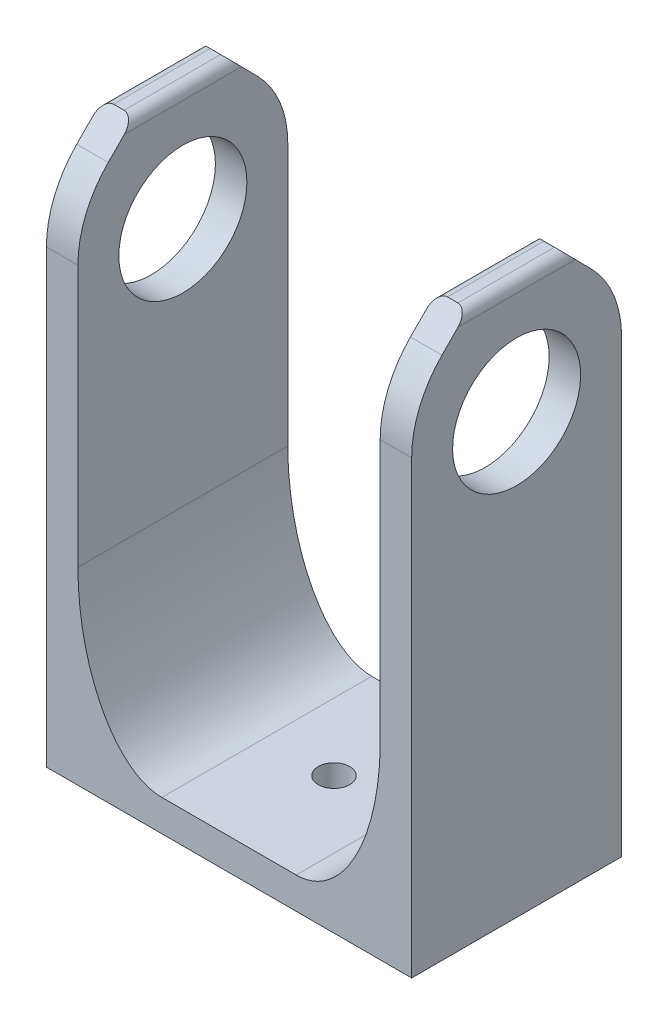
ISO-10303-21;
HEADER;
FILE_DESCRIPTION(('STEP AP214'),'2;1');
FILE_NAME('part.step','',(''),(''),'','','');
FILE_SCHEMA(('AUTOMOTIVE_DESIGN { 1 0 10303 214 1 1 1 1 }'));
ENDSEC;
DATA;
#1=APPLICATION_CONTEXT('core data for automotive mechanical design processes');
#2=APPLICATION_PROTOCOL_DEFINITION('international standard','automotive_design',2000,#1);
#3=PRODUCT_CONTEXT('',#1,'mechanical');
#4=PRODUCT('Part','Part','',(#3));
#5=PRODUCT_RELATED_PRODUCT_CATEGORY('part','',(#4));
#6=PRODUCT_DEFINITION_FORMATION('','',#4);
#7=PRODUCT_DEFINITION_CONTEXT('part definition',#1,'design');
#8=PRODUCT_DEFINITION('design','',#6,#7);
#9=PRODUCT_DEFINITION_SHAPE('','',#8);
#10=(LENGTH_UNIT() NAMED_UNIT(*) SI_UNIT(.MILLI.,.METRE.));
#11=(NAMED_UNIT(*) PLANE_ANGLE_UNIT() SI_UNIT($,.RADIAN.));
#12=(NAMED_UNIT(*) SI_UNIT($,.STERADIAN.) SOLID_ANGLE_UNIT());
#13=UNCERTAINTY_MEASURE_WITH_UNIT(LENGTH_MEASURE(1.E-05),#10,'distance_accuracy_value','');
#14=(GEOMETRIC_REPRESENTATION_CONTEXT(3) GLOBAL_UNCERTAINTY_ASSIGNED_CONTEXT((#13)) GLOBAL_UNIT_ASSIGNED_CONTEXT((#10,
#11,#12)) REPRESENTATION_CONTEXT('',''));
#15=CARTESIAN_POINT('',(0.,0.,0.));
#16=DIRECTION('',(0.,0.,1.));
#17=DIRECTION('',(1.,0.,0.));
#18=AXIS2_PLACEMENT_3D('',#15,#16,#17);
#19=CARTESIAN_POINT('',(-18.0339316449471,1.33142857142857,20.));
#20=DIRECTION('',(1.,0.,0.));
#21=DIRECTION('',(0.,0.,-1.));
#22=AXIS2_PLACEMENT_3D('',#19,#20,#21);
#23=PLANE('',#22);
#24=CARTESIAN_POINT('',(-18.0339316449471,10.5436734693878,10.));
#25=DIRECTION('',(1.,0.,0.));
#26=DIRECTION('',(0.,0.,-1.));
#27=AXIS2_PLACEMENT_3D('',#24,#25,#26);
#28=CIRCLE('',#27,6.1);
#29=CARTESIAN_POINT('',(-18.0339316449471,10.5436734693878,3.9));
#30=VERTEX_POINT('',#29);
#31=EDGE_CURVE('E650',#30,#30,#28,.F.);
#32=ORIENTED_EDGE('',*,*,#31,.F.);
#33=EDGE_LOOP('',(#32));
#34=FACE_BOUND('',#33,.T.);
#35=DIRECTION('',(0.,-1.,0.));
#36=VECTOR('',#35,1.);
#37=CARTESIAN_POINT('',(-18.0339316449471,20.3165435613168,20.));
#38=LINE('',#37,#36);
#39=CARTESIAN_POINT('',(-18.0339316449471,11.7410548552474,20.));
#40=VERTEX_POINT('',#39);
#41=CARTESIAN_POINT('',(-18.0339316449471,-31.1834564386832,20.));
#42=VERTEX_POINT('',#41);
#43=EDGE_CURVE('E639',#40,#42,#38,.T.);
#44=ORIENTED_EDGE('',*,*,#43,.F.);
#45=CARTESIAN_POINT('',(-18.0339316449471,11.7410548552474,10.));
#46=DIRECTION('',(1.,0.,0.));
#47=DIRECTION('',(0.,0.,-1.));
#48=AXIS2_PLACEMENT_3D('',#45,#46,#47);
#49=CIRCLE('',#48,10.);
#50=CARTESIAN_POINT('',(-18.0339316449471,18.7687746927255,17.1141516631231));
#51=VERTEX_POINT('',#50);
#52=EDGE_CURVE('E308',#40,#51,#49,.F.);
#53=ORIENTED_EDGE('',*,*,#52,.T.);
#54=DIRECTION('',(0.,-0.711415166312307,0.702771983747811));
#55=VECTOR('',#54,1.);
#56=CARTESIAN_POINT('',(-18.0339316449471,15.8474341697542,20.));
#57=LINE('',#56,#55);
#58=CARTESIAN_POINT('',(-18.0339316449471,20.3165435613168,15.585187073007));
#59=VERTEX_POINT('',#58);
#60=EDGE_CURVE('E231',#59,#51,#57,.T.);
#61=ORIENTED_EDGE('',*,*,#60,.F.);
#62=DIRECTION('',(0.,0.,-1.));
#63=VECTOR('',#62,1.);
#64=CARTESIAN_POINT('',(-18.0339316449471,20.3165435613168,20.));
#65=LINE('',#64,#63);
#66=CARTESIAN_POINT('',(-18.0339316449471,20.3165435613168,4.41481292699299));
#67=VERTEX_POINT('',#66);
#68=EDGE_CURVE('E222',#59,#67,#65,.T.);
#69=ORIENTED_EDGE('',*,*,#68,.T.);
#70=DIRECTION('',(0.,0.711415166312306,0.702771983747812));
#71=VECTOR('',#70,1.);
#72=CARTESIAN_POINT('',(-18.0339316449471,15.8474341697542,0.));
#73=LINE('',#72,#71);
#74=CARTESIAN_POINT('',(-18.0339316449471,18.7687746927255,2.88584833687694));
#75=VERTEX_POINT('',#74);
#76=EDGE_CURVE('E203',#75,#67,#73,.T.);
#77=ORIENTED_EDGE('',*,*,#76,.F.);
#78=CARTESIAN_POINT('',(-18.0339316449471,11.7410548552474,10.));
#79=DIRECTION('',(1.,0.,0.));
#80=DIRECTION('',(0.,0.,-1.));
#81=AXIS2_PLACEMENT_3D('',#78,#79,#80);
#82=CIRCLE('',#81,10.);
#83=CARTESIAN_POINT('',(-18.0339316449471,11.7410548552474,0.));
#84=VERTEX_POINT('',#83);
#85=EDGE_CURVE('E305',#75,#84,#82,.F.);
#86=ORIENTED_EDGE('',*,*,#85,.T.);
#87=DIRECTION('',(0.,-1.,0.));
#88=VECTOR('',#87,1.);
#89=CARTESIAN_POINT('',(-18.0339316449471,1.33142857142857,0.));
#90=LINE('',#89,#88);
#91=CARTESIAN_POINT('',(-18.0339316449471,-31.1834564386832,0.));
#92=VERTEX_POINT('',#91);
#93=EDGE_CURVE('E349',#84,#92,#90,.T.);
#94=ORIENTED_EDGE('',*,*,#93,.T.);
#95=DIRECTION('',(0.,0.,-1.));
#96=VECTOR('',#95,1.);
#97=CARTESIAN_POINT('',(-18.0339316449471,-31.1834564386832,20.));
#98=LINE('',#97,#96);
#99=EDGE_CURVE('E272',#42,#92,#98,.T.);
#100=ORIENTED_EDGE('',*,*,#99,.F.);
#101=EDGE_LOOP('',(#44,#53,#61,#69,#77,#86,#94,#100));
#102=FACE_BOUND('',#101,.T.);
#103=ADVANCED_FACE('F46',(#34,#102),#23,.F.);
#104=CARTESIAN_POINT('',(-18.0339316449471,-31.1834564386832,20.));
#105=DIRECTION('',(0.,1.,0.));
#106=DIRECTION('',(0.,0.,1.));
#107=AXIS2_PLACEMENT_3D('',#104,#105,#106);
#108=PLANE('',#107);
#109=CARTESIAN_POINT('',(-0.633931644947133,-31.1834564386832,10.));
#110=DIRECTION('',(0.,-1.,0.));
#111=DIRECTION('',(1.,0.,0.));
#112=AXIS2_PLACEMENT_3D('',#109,#110,#111);
#113=CIRCLE('',#112,1.5);
#114=CARTESIAN_POINT('',(0.866068355052867,-31.1834564386832,10.));
#115=VERTEX_POINT('',#114);
#116=EDGE_CURVE('E288',#115,#115,#113,.T.);
#117=ORIENTED_EDGE('',*,*,#116,.F.);
#118=EDGE_LOOP('',(#117));
#119=FACE_BOUND('',#118,.T.);
#120=DIRECTION('',(1.,0.,0.));
#121=VECTOR('',#120,1.);
#122=CARTESIAN_POINT('',(-18.0339316449471,-31.1834564386832,0.));
#123=LINE('',#122,#121);
#124=CARTESIAN_POINT('',(16.7660683550529,-31.1834564386832,0.));
#125=VERTEX_POINT('',#124);
#126=EDGE_CURVE('E352',#92,#125,#123,.T.);
#127=ORIENTED_EDGE('',*,*,#126,.T.);
#128=DIRECTION('',(0.,0.,-1.));
#129=VECTOR('',#128,1.);
#130=CARTESIAN_POINT('',(16.7660683550529,-31.1834564386832,20.));
#131=LINE('',#130,#129);
#132=CARTESIAN_POINT('',(16.7660683550529,-31.1834564386832,20.));
#133=VERTEX_POINT('',#132);
#134=EDGE_CURVE('E268',#133,#125,#131,.T.);
#135=ORIENTED_EDGE('',*,*,#134,.F.);
#136=DIRECTION('',(1.,0.,0.));
#137=VECTOR('',#136,1.);
#138=CARTESIAN_POINT('',(-18.0339316449471,-31.1834564386832,20.));
#139=LINE('',#138,#137);
#140=EDGE_CURVE('E708',#42,#133,#139,.T.);
#141=ORIENTED_EDGE('',*,*,#140,.F.);
#142=ORIENTED_EDGE('',*,*,#99,.T.);
#143=EDGE_LOOP('',(#127,#135,#141,#142));
#144=FACE_BOUND('',#143,.T.);
#145=ADVANCED_FACE('F402',(#119,#144),#108,.F.);
#146=CARTESIAN_POINT('',(16.7660683550529,-31.1834564386832,20.));
#147=DIRECTION('',(-1.,0.,0.));
#148=DIRECTION('',(0.,0.,1.));
#149=AXIS2_PLACEMENT_3D('',#146,#147,#148);
#150=PLANE('',#149);
#151=CARTESIAN_POINT('',(16.7660683550529,10.5436734693877,10.));
#152=DIRECTION('',(1.,0.,0.));
#153=DIRECTION('',(0.,1.,0.));
#154=AXIS2_PLACEMENT_3D('',#151,#152,#153);
#155=CIRCLE('',#154,6.1);
#156=CARTESIAN_POINT('',(16.7660683550529,16.6436734693877,10.));
#157=VERTEX_POINT('',#156);
#158=EDGE_CURVE('E644',#157,#157,#155,.T.);
#159=ORIENTED_EDGE('',*,*,#158,.F.);
#160=EDGE_LOOP('',(#159));
#161=FACE_BOUND('',#160,.T.);
#162=DIRECTION('',(0.,0.711415166312307,-0.702771983747811));
#163=VECTOR('',#162,1.);
#164=CARTESIAN_POINT('',(16.7660683550529,15.8474341697542,20.));
#165=LINE('',#164,#163);
#166=CARTESIAN_POINT('',(16.7660683550529,18.7687746927255,17.1141516631231));
#167=VERTEX_POINT('',#166);
#168=CARTESIAN_POINT('',(16.7660683550529,20.3165435613168,15.585187073007));
#169=VERTEX_POINT('',#168);
#170=EDGE_CURVE('E287',#167,#169,#165,.T.);
#171=ORIENTED_EDGE('',*,*,#170,.F.);
#172=CARTESIAN_POINT('',(16.7660683550529,11.7410548552474,10.));
#173=DIRECTION('',(-1.,0.,0.));
#174=DIRECTION('',(0.,0.,1.));
#175=AXIS2_PLACEMENT_3D('',#172,#173,#174);
#176=CIRCLE('',#175,10.);
#177=CARTESIAN_POINT('',(16.7660683550529,11.7410548552474,20.));
#178=VERTEX_POINT('',#177);
#179=EDGE_CURVE('E328',#167,#178,#176,.F.);
#180=ORIENTED_EDGE('',*,*,#179,.T.);
#181=DIRECTION('',(0.,1.,0.));
#182=VECTOR('',#181,1.);
#183=CARTESIAN_POINT('',(16.7660683550529,-31.1834564386832,20.));
#184=LINE('',#183,#182);
#185=EDGE_CURVE('E711',#133,#178,#184,.T.);
#186=ORIENTED_EDGE('',*,*,#185,.F.);
#187=ORIENTED_EDGE('',*,*,#134,.T.);
#188=DIRECTION('',(0.,1.,0.));
#189=VECTOR('',#188,1.);
#190=CARTESIAN_POINT('',(16.7660683550529,-31.1834564386832,0.));
#191=LINE('',#190,#189);
#192=CARTESIAN_POINT('',(16.7660683550529,11.7410548552474,0.));
#193=VERTEX_POINT('',#192);
#194=EDGE_CURVE('E355',#125,#193,#191,.T.);
#195=ORIENTED_EDGE('',*,*,#194,.T.);
#196=CARTESIAN_POINT('',(16.7660683550529,11.7410548552474,10.));
#197=DIRECTION('',(-1.,0.,0.));
#198=DIRECTION('',(0.,0.,1.));
#199=AXIS2_PLACEMENT_3D('',#196,#197,#198);
#200=CIRCLE('',#199,10.);
#201=CARTESIAN_POINT('',(16.7660683550529,18.7687746927255,2.88584833687694));
#202=VERTEX_POINT('',#201);
#203=EDGE_CURVE('E325',#193,#202,#200,.F.);
#204=ORIENTED_EDGE('',*,*,#203,.T.);
#205=DIRECTION('',(0.,-0.711415166312306,-0.702771983747811));
#206=VECTOR('',#205,1.);
#207=CARTESIAN_POINT('',(16.7660683550529,15.8474341697542,0.));
#208=LINE('',#207,#206);
#209=CARTESIAN_POINT('',(16.7660683550529,20.3165435613168,4.41481292699299));
#210=VERTEX_POINT('',#209);
#211=EDGE_CURVE('E660',#210,#202,#208,.T.);
#212=ORIENTED_EDGE('',*,*,#211,.F.);
#213=DIRECTION('',(0.,0.,-1.));
#214=VECTOR('',#213,1.);
#215=CARTESIAN_POINT('',(16.7660683550529,20.3165435613168,20.));
#216=LINE('',#215,#214);
#217=EDGE_CURVE('E264',#169,#210,#216,.T.);
#218=ORIENTED_EDGE('',*,*,#217,.F.);
#219=EDGE_LOOP('',(#171,#180,#186,#187,#195,#204,#212,#218));
#220=FACE_BOUND('',#219,.T.);
#221=ADVANCED_FACE('F398',(#161,#220),#150,.F.);
#222=CARTESIAN_POINT('',(15.7660683550529,20.3165435613168,20.));
#223=DIRECTION('',(0.,0.,-1.));
#224=DIRECTION('',(-1.,0.,0.));
#225=AXIS2_PLACEMENT_3D('',#222,#223,#224);
#226=CYLINDRICAL_SURFACE('',#225,1.);
#227=DIRECTION('',(0.,0.,-1.));
#228=VECTOR('',#227,1.);
#229=CARTESIAN_POINT('',(15.7660683550529,21.3165435613168,20.));
#230=LINE('',#229,#228);
#231=CARTESIAN_POINT('',(15.7660683550529,21.3165435613168,14.5973363537277));
#232=VERTEX_POINT('',#231);
#233=CARTESIAN_POINT('',(15.7660683550529,21.3165435613168,5.40266364627229));
#234=VERTEX_POINT('',#233);
#235=EDGE_CURVE('E260',#232,#234,#230,.T.);
#236=ORIENTED_EDGE('',*,*,#235,.F.);
#237=CARTESIAN_POINT('',(15.7660683550529,20.3165435613168,15.585187073007));
#238=DIRECTION('',(0.,-0.702771983747811,-0.711415166312307));
#239=DIRECTION('',(0.,0.711415166312307,-0.702771983747811));
#240=AXIS2_PLACEMENT_3D('',#237,#238,#239);
#241=ELLIPSE('',#240,1.40564897594692,1.);
#242=EDGE_CURVE('E282',#232,#169,#241,.T.);
#243=ORIENTED_EDGE('',*,*,#242,.T.);
#244=ORIENTED_EDGE('',*,*,#217,.T.);
#245=CARTESIAN_POINT('',(15.7660683550529,20.3165435613168,4.41481292699298));
#246=DIRECTION('',(0.,-0.702771983747812,0.711415166312306));
#247=DIRECTION('',(0.,-0.711415166312306,-0.702771983747812));
#248=AXIS2_PLACEMENT_3D('',#245,#246,#247);
#249=ELLIPSE('',#248,1.40564897594692,1.);
#250=EDGE_CURVE('E681',#210,#234,#249,.T.);
#251=ORIENTED_EDGE('',*,*,#250,.T.);
#252=EDGE_LOOP('',(#236,#243,#244,#251));
#253=FACE_BOUND('',#252,.T.);
#254=ADVANCED_FACE('F394',(#253),#226,.T.);
#255=CARTESIAN_POINT('',(15.7660683550529,21.3165435613168,20.));
#256=DIRECTION('',(0.,-1.,0.));
#257=DIRECTION('',(0.,0.,-1.));
#258=AXIS2_PLACEMENT_3D('',#255,#256,#257);
#259=PLANE('',#258);
#260=DIRECTION('',(0.,0.,-1.));
#261=VECTOR('',#260,1.);
#262=CARTESIAN_POINT('',(14.7660683550529,21.3165435613168,20.));
#263=LINE('',#262,#261);
#264=CARTESIAN_POINT('',(14.7660683550529,21.3165435613168,14.5973363537277));
#265=VERTEX_POINT('',#264);
#266=CARTESIAN_POINT('',(14.7660683550529,21.3165435613168,5.40266364627228));
#267=VERTEX_POINT('',#266);
#268=EDGE_CURVE('E256',#265,#267,#263,.T.);
#269=ORIENTED_EDGE('',*,*,#268,.F.);
#270=DIRECTION('',(1.,0.,0.));
#271=VECTOR('',#270,1.);
#272=CARTESIAN_POINT('',(-35.2873371058989,21.3165435613168,14.5973363537277));
#273=LINE('',#272,#271);
#274=EDGE_CURVE('E653',#265,#232,#273,.T.);
#275=ORIENTED_EDGE('',*,*,#274,.T.);
#276=ORIENTED_EDGE('',*,*,#235,.T.);
#277=DIRECTION('',(1.,0.,0.));
#278=VECTOR('',#277,1.);
#279=CARTESIAN_POINT('',(-35.2873371058989,21.3165435613168,5.40266364627229));
#280=LINE('',#279,#278);
#281=EDGE_CURVE('E664',#267,#234,#280,.T.);
#282=ORIENTED_EDGE('',*,*,#281,.F.);
#283=EDGE_LOOP('',(#269,#275,#276,#282));
#284=FACE_BOUND('',#283,.T.);
#285=ADVANCED_FACE('F390',(#284),#259,.F.);
#286=CARTESIAN_POINT('',(14.7660683550529,20.3165435613168,20.));
#287=DIRECTION('',(0.,0.,-1.));
#288=DIRECTION('',(-1.,0.,0.));
#289=AXIS2_PLACEMENT_3D('',#286,#287,#288);
#290=CYLINDRICAL_SURFACE('',#289,1.);
#291=DIRECTION('',(0.,0.,-1.));
#292=VECTOR('',#291,1.);
#293=CARTESIAN_POINT('',(13.7660683550529,20.3165435613168,20.));
#294=LINE('',#293,#292);
#295=CARTESIAN_POINT('',(13.7660683550529,20.3165435613168,15.585187073007));
#296=VERTEX_POINT('',#295);
#297=CARTESIAN_POINT('',(13.7660683550529,20.3165435613168,4.41481292699298));
#298=VERTEX_POINT('',#297);
#299=EDGE_CURVE('E252',#296,#298,#294,.T.);
#300=ORIENTED_EDGE('',*,*,#299,.F.);
#301=CARTESIAN_POINT('',(14.7660683550529,20.3165435613168,15.585187073007));
#302=DIRECTION('',(0.,-0.702771983747811,-0.711415166312307));
#303=DIRECTION('',(0.,0.711415166312307,-0.702771983747811));
#304=AXIS2_PLACEMENT_3D('',#301,#302,#303);
#305=ELLIPSE('',#304,1.40564897594692,1.);
#306=EDGE_CURVE('E696',#296,#265,#305,.T.);
#307=ORIENTED_EDGE('',*,*,#306,.T.);
#308=ORIENTED_EDGE('',*,*,#268,.T.);
#309=CARTESIAN_POINT('',(14.7660683550529,20.3165435613168,4.41481292699298));
#310=DIRECTION('',(0.,-0.702771983747812,0.711415166312306));
#311=DIRECTION('',(0.,-0.711415166312306,-0.702771983747812));
#312=AXIS2_PLACEMENT_3D('',#309,#310,#311);
#313=ELLIPSE('',#312,1.40564897594692,1.);
#314=EDGE_CURVE('E677',#267,#298,#313,.T.);
#315=ORIENTED_EDGE('',*,*,#314,.T.);
#316=EDGE_LOOP('',(#300,#307,#308,#315));
#317=FACE_BOUND('',#316,.T.);
#318=ADVANCED_FACE('F384',(#317),#290,.T.);
#319=CARTESIAN_POINT('',(13.7660683550529,-23.2766776493224,20.));
#320=DIRECTION('',(1.,0.,0.));
#321=DIRECTION('',(0.,0.,-1.));
#322=AXIS2_PLACEMENT_3D('',#319,#320,#321);
#323=PLANE('',#322);
#324=CARTESIAN_POINT('',(13.7660683550529,10.5436734693877,10.));
#325=DIRECTION('',(1.,0.,0.));
#326=DIRECTION('',(0.,0.,-1.));
#327=AXIS2_PLACEMENT_3D('',#324,#325,#326);
#328=CIRCLE('',#327,6.1);
#329=CARTESIAN_POINT('',(13.7660683550529,10.5436734693877,3.9));
#330=VERTEX_POINT('',#329);
#331=EDGE_CURVE('E281',#330,#330,#328,.T.);
#332=ORIENTED_EDGE('',*,*,#331,.T.);
#333=EDGE_LOOP('',(#332));
#334=FACE_BOUND('',#333,.T.);
#335=DIRECTION('',(0.,-1.,0.));
#336=VECTOR('',#335,1.);
#337=CARTESIAN_POINT('',(13.7660683550529,-23.2766776493224,0.));
#338=LINE('',#337,#336);
#339=CARTESIAN_POINT('',(13.7660683550529,11.7410548552474,0.));
#340=VERTEX_POINT('',#339);
#341=CARTESIAN_POINT('',(13.7660683550529,-13.1834564386832,0.));
#342=VERTEX_POINT('',#341);
#343=EDGE_CURVE('E359',#340,#342,#338,.T.);
#344=ORIENTED_EDGE('',*,*,#343,.T.);
#345=CARTESIAN_POINT('',(13.7660683550529,-13.1834564386832,21.));
#346=CARTESIAN_POINT('',(13.7660683550529,-13.1834564386832,13.6666666666667));
#347=CARTESIAN_POINT('',(13.7660683550529,-13.1834564386832,6.33333333333333));
#348=CARTESIAN_POINT('',(13.7660683550529,-13.1834564386832,-1.));
#349=(BOUNDED_CURVE() B_SPLINE_CURVE(3,(#345,#346,#347,#348),.UNSPECIFIED.,.F.,
.F.) B_SPLINE_CURVE_WITH_KNOTS((4,4),(-0.021,0.001),
.UNSPECIFIED.) CURVE() GEOMETRIC_REPRESENTATION_ITEM() RATIONAL_B_SPLINE_CURVE((1.,1.,1.,1.)) REPRESENTATION_ITEM(''));
#350=CARTESIAN_POINT('',(13.7660683550529,-13.1834564386832,20.));
#351=VERTEX_POINT('',#350);
#352=EDGE_CURVE('E75',#342,#351,#349,.F.);
#353=ORIENTED_EDGE('',*,*,#352,.T.);
#354=DIRECTION('',(0.,-1.,0.));
#355=VECTOR('',#354,1.);
#356=CARTESIAN_POINT('',(13.7660683550529,20.3165435613168,20.));
#357=LINE('',#356,#355);
#358=CARTESIAN_POINT('',(13.7660683550529,11.7410548552474,20.));
#359=VERTEX_POINT('',#358);
#360=EDGE_CURVE('E366',#359,#351,#357,.T.);
#361=ORIENTED_EDGE('',*,*,#360,.F.);
#362=CARTESIAN_POINT('',(13.7660683550529,11.7410548552474,10.));
#363=DIRECTION('',(1.,0.,0.));
#364=DIRECTION('',(0.,0.,-1.));
#365=AXIS2_PLACEMENT_3D('',#362,#363,#364);
#366=CIRCLE('',#365,10.);
#367=CARTESIAN_POINT('',(13.7660683550529,18.7687746927255,17.1141516631231));
#368=VERTEX_POINT('',#367);
#369=EDGE_CURVE('E334',#359,#368,#366,.F.);
#370=ORIENTED_EDGE('',*,*,#369,.T.);
#371=DIRECTION('',(0.,0.711415166312307,-0.702771983747811));
#372=VECTOR('',#371,1.);
#373=CARTESIAN_POINT('',(13.7660683550529,-3.9537302694968,39.5605945338817));
#374=LINE('',#373,#372);
#375=EDGE_CURVE('E693',#368,#296,#374,.T.);
#376=ORIENTED_EDGE('',*,*,#375,.T.);
#377=ORIENTED_EDGE('',*,*,#299,.T.);
#378=DIRECTION('',(0.,-0.711415166312306,-0.702771983747812));
#379=VECTOR('',#378,1.);
#380=CARTESIAN_POINT('',(13.7660683550529,6.04552268445482,-9.68282531106501));
#381=LINE('',#380,#379);
#382=CARTESIAN_POINT('',(13.7660683550529,18.7687746927255,2.88584833687694));
#383=VERTEX_POINT('',#382);
#384=EDGE_CURVE('E673',#298,#383,#381,.T.);
#385=ORIENTED_EDGE('',*,*,#384,.T.);
#386=CARTESIAN_POINT('',(13.7660683550529,11.7410548552474,10.));
#387=DIRECTION('',(1.,0.,0.));
#388=DIRECTION('',(0.,0.,-1.));
#389=AXIS2_PLACEMENT_3D('',#386,#387,#388);
#390=CIRCLE('',#389,10.);
#391=EDGE_CURVE('E331',#383,#340,#390,.F.);
#392=ORIENTED_EDGE('',*,*,#391,.T.);
#393=EDGE_LOOP('',(#344,#353,#361,#370,#376,#377,#385,#392));
#394=FACE_BOUND('',#393,.T.);
#395=ADVANCED_FACE('F373',(#334,#394),#323,.F.);
#396=CARTESIAN_POINT('',(-15.0339316449471,-28.1834564386832,20.));
#397=DIRECTION('',(0.,-1.,0.));
#398=DIRECTION('',(0.,0.,-1.));
#399=AXIS2_PLACEMENT_3D('',#396,#397,#398);
#400=PLANE('',#399);
#401=CARTESIAN_POINT('',(-0.633931644947134,-28.1834564386832,10.));
#402=DIRECTION('',(0.,-1.,0.));
#403=DIRECTION('',(0.,0.,-1.));
#404=AXIS2_PLACEMENT_3D('',#401,#402,#403);
#405=CIRCLE('',#404,1.5);
#406=CARTESIAN_POINT('',(-0.633931644947134,-28.1834564386832,8.5));
#407=VERTEX_POINT('',#406);
#408=EDGE_CURVE('E283',#407,#407,#405,.T.);
#409=ORIENTED_EDGE('',*,*,#408,.T.);
#410=EDGE_LOOP('',(#409));
#411=FACE_BOUND('',#410,.T.);
#412=DIRECTION('',(-1.,0.,0.));
#413=VECTOR('',#412,1.);
#414=CARTESIAN_POINT('',(13.7660683550529,-28.1834564386832,20.));
#415=LINE('',#414,#413);
#416=CARTESIAN_POINT('',(5.76606835505287,-28.1834564386832,20.));
#417=VERTEX_POINT('',#416);
#418=CARTESIAN_POINT('',(-7.03393164494714,-28.1834564386832,20.));
#419=VERTEX_POINT('',#418);
#420=EDGE_CURVE('E239',#417,#419,#415,.T.);
#421=ORIENTED_EDGE('',*,*,#420,.F.);
#422=CARTESIAN_POINT('',(5.76606835505287,-28.1834564386832,-1.));
#423=CARTESIAN_POINT('',(5.76606835505287,-28.1834564386832,6.33333333333333));
#424=CARTESIAN_POINT('',(5.76606835505287,-28.1834564386832,13.6666666666667));
#425=CARTESIAN_POINT('',(5.76606835505287,-28.1834564386832,21.));
#426=(BOUNDED_CURVE() B_SPLINE_CURVE(3,(#422,#423,#424,#425),.UNSPECIFIED.,.F.,
.F.) B_SPLINE_CURVE_WITH_KNOTS((4,4),(-0.021,0.001),
.UNSPECIFIED.) CURVE() GEOMETRIC_REPRESENTATION_ITEM() RATIONAL_B_SPLINE_CURVE((1.,1.,1.,1.)) REPRESENTATION_ITEM(''));
#427=CARTESIAN_POINT('',(5.76606835505287,-28.1834564386832,0.));
#428=VERTEX_POINT('',#427);
#429=EDGE_CURVE('E511',#417,#428,#426,.F.);
#430=ORIENTED_EDGE('',*,*,#429,.T.);
#431=DIRECTION('',(-1.,0.,0.));
#432=VECTOR('',#431,1.);
#433=CARTESIAN_POINT('',(-15.0339316449471,-28.1834564386832,0.));
#434=LINE('',#433,#432);
#435=CARTESIAN_POINT('',(-7.03393164494714,-28.1834564386832,0.));
#436=VERTEX_POINT('',#435);
#437=EDGE_CURVE('E365',#428,#436,#434,.T.);
#438=ORIENTED_EDGE('',*,*,#437,.T.);
#439=CARTESIAN_POINT('',(-7.03393164494714,-28.1834564386832,21.));
#440=CARTESIAN_POINT('',(-7.03393164494714,-28.1834564386832,13.6666666666667));
#441=CARTESIAN_POINT('',(-7.03393164494714,-28.1834564386832,6.33333333333333));
#442=CARTESIAN_POINT('',(-7.03393164494714,-28.1834564386832,-1.));
#443=(BOUNDED_CURVE() B_SPLINE_CURVE(3,(#439,#440,#441,#442),.UNSPECIFIED.,.F.,
.F.) B_SPLINE_CURVE_WITH_KNOTS((4,4),(-0.021,0.001),
.UNSPECIFIED.) CURVE() GEOMETRIC_REPRESENTATION_ITEM() RATIONAL_B_SPLINE_CURVE((1.,1.,1.,1.)) REPRESENTATION_ITEM(''));
#444=EDGE_CURVE('E534',#436,#419,#443,.F.);
#445=ORIENTED_EDGE('',*,*,#444,.T.);
#446=EDGE_LOOP('',(#421,#430,#438,#445));
#447=FACE_BOUND('',#446,.T.);
#448=ADVANCED_FACE('F383',(#411,#447),#400,.F.);
#449=CARTESIAN_POINT('',(-15.0339316449471,-10.2766776493224,20.));
#450=DIRECTION('',(-1.,0.,0.));
#451=DIRECTION('',(0.,0.,1.));
#452=AXIS2_PLACEMENT_3D('',#449,#450,#451);
#453=PLANE('',#452);
#454=CARTESIAN_POINT('',(-15.0339316449471,10.5436734693878,10.));
#455=DIRECTION('',(-1.,0.,0.));
#456=DIRECTION('',(0.,0.,1.));
#457=AXIS2_PLACEMENT_3D('',#454,#455,#456);
#458=CIRCLE('',#457,6.1);
#459=CARTESIAN_POINT('',(-15.0339316449471,10.5436734693878,16.1));
#460=VERTEX_POINT('',#459);
#461=EDGE_CURVE('E277',#460,#460,#458,.T.);
#462=ORIENTED_EDGE('',*,*,#461,.T.);
#463=EDGE_LOOP('',(#462));
#464=FACE_BOUND('',#463,.T.);
#465=DIRECTION('',(0.,1.,0.));
#466=VECTOR('',#465,1.);
#467=CARTESIAN_POINT('',(-15.0339316449471,-23.5103497046971,20.));
#468=LINE('',#467,#466);
#469=CARTESIAN_POINT('',(-15.0339316449471,-13.1834564386832,20.));
#470=VERTEX_POINT('',#469);
#471=CARTESIAN_POINT('',(-15.0339316449471,11.7410548552474,20.));
#472=VERTEX_POINT('',#471);
#473=EDGE_CURVE('E233',#470,#472,#468,.T.);
#474=ORIENTED_EDGE('',*,*,#473,.F.);
#475=CARTESIAN_POINT('',(-15.0339316449471,-13.1834564386832,-1.));
#476=CARTESIAN_POINT('',(-15.0339316449471,-13.1834564386832,6.33333333333333));
#477=CARTESIAN_POINT('',(-15.0339316449471,-13.1834564386832,13.6666666666667));
#478=CARTESIAN_POINT('',(-15.0339316449471,-13.1834564386832,21.));
#479=(BOUNDED_CURVE() B_SPLINE_CURVE(3,(#475,#476,#477,#478),.UNSPECIFIED.,.F.,
.F.) B_SPLINE_CURVE_WITH_KNOTS((4,4),(-0.021,0.001),
.UNSPECIFIED.) CURVE() GEOMETRIC_REPRESENTATION_ITEM() RATIONAL_B_SPLINE_CURVE((1.,1.,1.,1.)) REPRESENTATION_ITEM(''));
#480=CARTESIAN_POINT('',(-15.0339316449471,-13.1834564386832,0.));
#481=VERTEX_POINT('',#480);
#482=EDGE_CURVE('E339',#470,#481,#479,.F.);
#483=ORIENTED_EDGE('',*,*,#482,.T.);
#484=DIRECTION('',(0.,1.,0.));
#485=VECTOR('',#484,1.);
#486=CARTESIAN_POINT('',(-15.0339316449471,-10.2766776493224,0.));
#487=LINE('',#486,#485);
#488=CARTESIAN_POINT('',(-15.0339316449471,11.7410548552474,0.));
#489=VERTEX_POINT('',#488);
#490=EDGE_CURVE('E342',#481,#489,#487,.T.);
#491=ORIENTED_EDGE('',*,*,#490,.T.);
#492=CARTESIAN_POINT('',(-15.0339316449471,11.7410548552474,10.));
#493=DIRECTION('',(-1.,0.,0.));
#494=DIRECTION('',(0.,0.,1.));
#495=AXIS2_PLACEMENT_3D('',#492,#493,#494);
#496=CIRCLE('',#495,10.);
#497=CARTESIAN_POINT('',(-15.0339316449471,18.7687746927255,2.88584833687694));
#498=VERTEX_POINT('',#497);
#499=EDGE_CURVE('E292',#489,#498,#496,.F.);
#500=ORIENTED_EDGE('',*,*,#499,.T.);
#501=DIRECTION('',(0.,0.711415166312306,0.702771983747812));
#502=VECTOR('',#501,1.);
#503=CARTESIAN_POINT('',(-15.0339316449471,12.624972689624,-3.18331089099649));
#504=LINE('',#503,#502);
#505=CARTESIAN_POINT('',(-15.0339316449471,20.3165435613168,4.41481292699299));
#506=VERTEX_POINT('',#505);
#507=EDGE_CURVE('E670',#498,#506,#504,.T.);
#508=ORIENTED_EDGE('',*,*,#507,.T.);
#509=DIRECTION('',(0.,0.,-1.));
#510=VECTOR('',#509,1.);
#511=CARTESIAN_POINT('',(-15.0339316449471,20.3165435613168,20.));
#512=LINE('',#511,#510);
#513=CARTESIAN_POINT('',(-15.0339316449471,20.3165435613168,15.585187073007));
#514=VERTEX_POINT('',#513);
#515=EDGE_CURVE('E248',#514,#506,#512,.T.);
#516=ORIENTED_EDGE('',*,*,#515,.F.);
#517=DIRECTION('',(0.,-0.711415166312307,0.702771983747811));
#518=VECTOR('',#517,1.);
#519=CARTESIAN_POINT('',(-15.0339316449471,2.62571973567237,33.0610801138132));
#520=LINE('',#519,#518);
#521=CARTESIAN_POINT('',(-15.0339316449471,18.7687746927255,17.1141516631231));
#522=VERTEX_POINT('',#521);
#523=EDGE_CURVE('E635',#514,#522,#520,.T.);
#524=ORIENTED_EDGE('',*,*,#523,.T.);
#525=CARTESIAN_POINT('',(-15.0339316449471,11.7410548552474,10.));
#526=DIRECTION('',(-1.,0.,0.));
#527=DIRECTION('',(0.,0.,1.));
#528=AXIS2_PLACEMENT_3D('',#525,#526,#527);
#529=CIRCLE('',#528,10.);
#530=EDGE_CURVE('E295',#522,#472,#529,.F.);
#531=ORIENTED_EDGE('',*,*,#530,.T.);
#532=EDGE_LOOP('',(#474,#483,#491,#500,#508,#516,#524,#531));
#533=FACE_BOUND('',#532,.T.);
#534=ADVANCED_FACE('F543',(#464,#533),#453,.F.);
#535=CARTESIAN_POINT('',(-16.0339316449471,20.3165435613168,20.));
#536=DIRECTION('',(0.,0.,-1.));
#537=DIRECTION('',(-1.,0.,0.));
#538=AXIS2_PLACEMENT_3D('',#535,#536,#537);
#539=CYLINDRICAL_SURFACE('',#538,1.);
#540=DIRECTION('',(0.,0.,-1.));
#541=VECTOR('',#540,1.);
#542=CARTESIAN_POINT('',(-16.0339316449471,21.3165435613168,20.));
#543=LINE('',#542,#541);
#544=CARTESIAN_POINT('',(-16.0339316449471,21.3165435613168,14.5973363537277));
#545=VERTEX_POINT('',#544);
#546=CARTESIAN_POINT('',(-16.0339316449471,21.3165435613168,5.40266364627229));
#547=VERTEX_POINT('',#546);
#548=EDGE_CURVE('E237',#545,#547,#543,.T.);
#549=ORIENTED_EDGE('',*,*,#548,.F.);
#550=CARTESIAN_POINT('',(-16.0339316449471,20.3165435613168,15.585187073007));
#551=DIRECTION('',(0.,-0.702771983747811,-0.711415166312307));
#552=DIRECTION('',(0.,0.711415166312307,-0.702771983747811));
#553=AXIS2_PLACEMENT_3D('',#550,#551,#552);
#554=ELLIPSE('',#553,1.40564897594692,1.);
#555=EDGE_CURVE('E687',#545,#514,#554,.T.);
#556=ORIENTED_EDGE('',*,*,#555,.T.);
#557=ORIENTED_EDGE('',*,*,#515,.T.);
#558=CARTESIAN_POINT('',(-16.0339316449471,20.3165435613168,4.41481292699299));
#559=DIRECTION('',(0.,-0.702771983747812,0.711415166312306));
#560=DIRECTION('',(0.,-0.711415166312306,-0.702771983747812));
#561=AXIS2_PLACEMENT_3D('',#558,#559,#560);
#562=ELLIPSE('',#561,1.40564897594692,1.);
#563=EDGE_CURVE('E226',#506,#547,#562,.T.);
#564=ORIENTED_EDGE('',*,*,#563,.T.);
#565=EDGE_LOOP('',(#549,#556,#557,#564));
#566=FACE_BOUND('',#565,.T.);
#567=ADVANCED_FACE('F556',(#566),#539,.T.);
#568=CARTESIAN_POINT('',(-16.0339316449471,21.3165435613168,20.));
#569=DIRECTION('',(0.,-1.,0.));
#570=DIRECTION('',(0.,0.,-1.));
#571=AXIS2_PLACEMENT_3D('',#568,#569,#570);
#572=PLANE('',#571);
#573=DIRECTION('',(0.,0.,-1.));
#574=VECTOR('',#573,1.);
#575=CARTESIAN_POINT('',(-17.0339316449471,21.3165435613168,20.));
#576=LINE('',#575,#574);
#577=CARTESIAN_POINT('',(-17.0339316449471,21.3165435613168,14.5973363537277));
#578=VERTEX_POINT('',#577);
#579=CARTESIAN_POINT('',(-17.0339316449471,21.3165435613168,5.40266364627228));
#580=VERTEX_POINT('',#579);
#581=EDGE_CURVE('E224',#578,#580,#576,.T.);
#582=ORIENTED_EDGE('',*,*,#581,.F.);
#583=EDGE_CURVE('E645',#578,#545,#273,.T.);
#584=ORIENTED_EDGE('',*,*,#583,.T.);
#585=ORIENTED_EDGE('',*,*,#548,.T.);
#586=EDGE_CURVE('E215',#580,#547,#280,.T.);
#587=ORIENTED_EDGE('',*,*,#586,.F.);
#588=EDGE_LOOP('',(#582,#584,#585,#587));
#589=FACE_BOUND('',#588,.T.);
#590=ADVANCED_FACE('F560',(#589),#572,.F.);
#591=CARTESIAN_POINT('',(-17.0339316449471,20.3165435613168,20.));
#592=DIRECTION('',(0.,0.,-1.));
#593=DIRECTION('',(-1.,0.,0.));
#594=AXIS2_PLACEMENT_3D('',#591,#592,#593);
#595=CYLINDRICAL_SURFACE('',#594,1.);
#596=ORIENTED_EDGE('',*,*,#68,.F.);
#597=CARTESIAN_POINT('',(-17.0339316449471,20.3165435613168,15.585187073007));
#598=DIRECTION('',(0.,-0.702771983747811,-0.711415166312307));
#599=DIRECTION('',(0.,0.711415166312307,-0.702771983747811));
#600=AXIS2_PLACEMENT_3D('',#597,#598,#599);
#601=ELLIPSE('',#600,1.40564897594692,1.);
#602=EDGE_CURVE('E642',#59,#578,#601,.T.);
#603=ORIENTED_EDGE('',*,*,#602,.T.);
#604=ORIENTED_EDGE('',*,*,#581,.T.);
#605=CARTESIAN_POINT('',(-17.0339316449471,20.3165435613168,4.41481292699299));
#606=DIRECTION('',(0.,-0.702771983747812,0.711415166312306));
#607=DIRECTION('',(0.,-0.711415166312306,-0.702771983747812));
#608=AXIS2_PLACEMENT_3D('',#605,#606,#607);
#609=ELLIPSE('',#608,1.40564897594692,1.);
#610=EDGE_CURVE('E207',#580,#67,#609,.T.);
#611=ORIENTED_EDGE('',*,*,#610,.T.);
#612=EDGE_LOOP('',(#596,#603,#604,#611));
#613=FACE_BOUND('',#612,.T.);
#614=ADVANCED_FACE('F220',(#613),#595,.T.);
#615=CARTESIAN_POINT('',(15.7660683550529,20.3165435613168,20.));
#616=DIRECTION('',(0.,0.,1.));
#617=DIRECTION('',(1.,0.,0.));
#618=AXIS2_PLACEMENT_3D('',#615,#616,#617);
#619=PLANE('',#618);
#620=ORIENTED_EDGE('',*,*,#360,.T.);
#621=CARTESIAN_POINT('',(5.76606835505287,-28.1834564386832,20.));
#622=CARTESIAN_POINT('',(13.7660683550529,-28.1834564386832,20.));
#623=CARTESIAN_POINT('',(13.7660683550529,-13.1834564386832,20.));
#624=(BOUNDED_CURVE() B_SPLINE_CURVE(2,(#621,#622,#623),.UNSPECIFIED.,.F.,
.F.) B_SPLINE_CURVE_WITH_KNOTS((3,3),(0.,1.),
.UNSPECIFIED.) CURVE() GEOMETRIC_REPRESENTATION_ITEM() RATIONAL_B_SPLINE_CURVE((1.,
0.707106781186548,1.)) REPRESENTATION_ITEM(''));
#625=EDGE_CURVE('E12',#351,#417,#624,.F.);
#626=ORIENTED_EDGE('',*,*,#625,.T.);
#627=ORIENTED_EDGE('',*,*,#420,.T.);
#628=CARTESIAN_POINT('',(-15.0339316449471,-13.1834564386832,20.));
#629=CARTESIAN_POINT('',(-15.0339316449471,-28.1834564386832,20.));
#630=CARTESIAN_POINT('',(-7.03393164494714,-28.1834564386832,20.));
#631=(BOUNDED_CURVE() B_SPLINE_CURVE(2,(#628,#629,#630),.UNSPECIFIED.,.F.,
.F.) B_SPLINE_CURVE_WITH_KNOTS((3,3),(0.,1.),
.UNSPECIFIED.) CURVE() GEOMETRIC_REPRESENTATION_ITEM() RATIONAL_B_SPLINE_CURVE((1.,
0.707106781186548,1.)) REPRESENTATION_ITEM(''));
#632=EDGE_CURVE('E525',#419,#470,#631,.F.);
#633=ORIENTED_EDGE('',*,*,#632,.T.);
#634=ORIENTED_EDGE('',*,*,#473,.T.);
#635=DIRECTION('',(1.,0.,0.));
#636=VECTOR('',#635,1.);
#637=CARTESIAN_POINT('',(-18.0339316449471,11.7410548552474,20.));
#638=LINE('',#637,#636);
#639=EDGE_CURVE('E302',#472,#40,#638,.F.);
#640=ORIENTED_EDGE('',*,*,#639,.T.);
#641=ORIENTED_EDGE('',*,*,#43,.T.);
#642=ORIENTED_EDGE('',*,*,#140,.T.);
#643=ORIENTED_EDGE('',*,*,#185,.T.);
#644=DIRECTION('',(1.,0.,0.));
#645=VECTOR('',#644,1.);
#646=CARTESIAN_POINT('',(13.7660683550528,11.7410548552474,20.));
#647=LINE('',#646,#645);
#648=EDGE_CURVE('E299',#178,#359,#647,.F.);
#649=ORIENTED_EDGE('',*,*,#648,.T.);
#650=EDGE_LOOP('',(#620,#626,#627,#633,#634,#640,#641,#642,#643,#649));
#651=FACE_BOUND('',#650,.T.);
#652=ADVANCED_FACE('F567',(#651),#619,.T.);
#653=CARTESIAN_POINT('',(15.7660683550529,20.3165435613168,0.));
#654=DIRECTION('',(0.,0.,1.));
#655=DIRECTION('',(1.,0.,0.));
#656=AXIS2_PLACEMENT_3D('',#653,#654,#655);
#657=PLANE('',#656);
#658=ORIENTED_EDGE('',*,*,#93,.F.);
#659=DIRECTION('',(1.,0.,0.));
#660=VECTOR('',#659,1.);
#661=CARTESIAN_POINT('',(15.7660683550529,11.7410548552474,0.));
#662=LINE('',#661,#660);
#663=EDGE_CURVE('E315',#84,#489,#662,.T.);
#664=ORIENTED_EDGE('',*,*,#663,.T.);
#665=ORIENTED_EDGE('',*,*,#490,.F.);
#666=CARTESIAN_POINT('',(-7.03393164494714,-28.1834564386832,0.));
#667=CARTESIAN_POINT('',(-15.0339316449471,-28.1834564386832,0.));
#668=CARTESIAN_POINT('',(-15.0339316449471,-13.1834564386832,0.));
#669=(BOUNDED_CURVE() B_SPLINE_CURVE(2,(#666,#667,#668),.UNSPECIFIED.,.F.,
.F.) B_SPLINE_CURVE_WITH_KNOTS((3,3),(0.,1.),
.UNSPECIFIED.) CURVE() GEOMETRIC_REPRESENTATION_ITEM() RATIONAL_B_SPLINE_CURVE((1.,
0.707106781186548,1.)) REPRESENTATION_ITEM(''));
#670=EDGE_CURVE('E529',#481,#436,#669,.F.);
#671=ORIENTED_EDGE('',*,*,#670,.T.);
#672=ORIENTED_EDGE('',*,*,#437,.F.);
#673=CARTESIAN_POINT('',(13.7660683550529,-13.1834564386832,0.));
#674=CARTESIAN_POINT('',(13.7660683550529,-28.1834564386832,0.));
#675=CARTESIAN_POINT('',(5.76606835505287,-28.1834564386832,0.));
#676=(BOUNDED_CURVE() B_SPLINE_CURVE(2,(#673,#674,#675),.UNSPECIFIED.,.F.,
.F.) B_SPLINE_CURVE_WITH_KNOTS((3,3),(0.,1.),
.UNSPECIFIED.) CURVE() GEOMETRIC_REPRESENTATION_ITEM() RATIONAL_B_SPLINE_CURVE((1.,
0.707106781186548,1.)) REPRESENTATION_ITEM(''));
#677=EDGE_CURVE('E61',#428,#342,#676,.F.);
#678=ORIENTED_EDGE('',*,*,#677,.T.);
#679=ORIENTED_EDGE('',*,*,#343,.F.);
#680=DIRECTION('',(1.,0.,0.));
#681=VECTOR('',#680,1.);
#682=CARTESIAN_POINT('',(15.7660683550529,11.7410548552474,0.));
#683=LINE('',#682,#681);
#684=EDGE_CURVE('E311',#340,#193,#683,.T.);
#685=ORIENTED_EDGE('',*,*,#684,.T.);
#686=ORIENTED_EDGE('',*,*,#194,.F.);
#687=ORIENTED_EDGE('',*,*,#126,.F.);
#688=EDGE_LOOP('',(#658,#664,#665,#671,#672,#678,#679,#685,#686,#687));
#689=FACE_BOUND('',#688,.T.);
#690=ADVANCED_FACE('F527',(#689),#657,.F.);
#691=CARTESIAN_POINT('',(-35.2873371058989,15.8474341697542,0.));
#692=DIRECTION('',(0.,-0.702771983747812,0.711415166312306));
#693=DIRECTION('',(0.,-0.711415166312306,-0.702771983747812));
#694=AXIS2_PLACEMENT_3D('',#691,#692,#693);
#695=PLANE('',#694);
#696=ORIENTED_EDGE('',*,*,#211,.T.);
#697=DIRECTION('',(1.,0.,0.));
#698=VECTOR('',#697,1.);
#699=CARTESIAN_POINT('',(-35.2873371058989,18.7687746927255,2.88584833687694));
#700=LINE('',#699,#698);
#701=EDGE_CURVE('E337',#202,#383,#700,.F.);
#702=ORIENTED_EDGE('',*,*,#701,.T.);
#703=ORIENTED_EDGE('',*,*,#384,.F.);
#704=ORIENTED_EDGE('',*,*,#314,.F.);
#705=ORIENTED_EDGE('',*,*,#281,.T.);
#706=ORIENTED_EDGE('',*,*,#250,.F.);
#707=EDGE_LOOP('',(#696,#702,#703,#704,#705,#706));
#708=FACE_BOUND('',#707,.T.);
#709=ADVANCED_FACE('F571',(#708),#695,.F.);
#710=ORIENTED_EDGE('',*,*,#507,.F.);
#711=DIRECTION('',(1.,0.,0.));
#712=VECTOR('',#711,1.);
#713=CARTESIAN_POINT('',(-35.2873371058989,18.7687746927255,2.88584833687694));
#714=LINE('',#713,#712);
#715=EDGE_CURVE('E210',#498,#75,#714,.F.);
#716=ORIENTED_EDGE('',*,*,#715,.T.);
#717=ORIENTED_EDGE('',*,*,#76,.T.);
#718=ORIENTED_EDGE('',*,*,#610,.F.);
#719=ORIENTED_EDGE('',*,*,#586,.T.);
#720=ORIENTED_EDGE('',*,*,#563,.F.);
#721=EDGE_LOOP('',(#710,#716,#717,#718,#719,#720));
#722=FACE_BOUND('',#721,.T.);
#723=ADVANCED_FACE('F206',(#722),#695,.F.);
#724=CARTESIAN_POINT('',(-35.2873371058989,15.8474341697542,20.));
#725=DIRECTION('',(0.,-0.702771983747811,-0.711415166312307));
#726=DIRECTION('',(0.,0.711415166312307,-0.702771983747811));
#727=AXIS2_PLACEMENT_3D('',#724,#725,#726);
#728=PLANE('',#727);
#729=ORIENTED_EDGE('',*,*,#375,.F.);
#730=DIRECTION('',(1.,0.,0.));
#731=VECTOR('',#730,1.);
#732=CARTESIAN_POINT('',(16.7660683550529,18.7687746927255,17.1141516631231));
#733=LINE('',#732,#731);
#734=EDGE_CURVE('E321',#368,#167,#733,.T.);
#735=ORIENTED_EDGE('',*,*,#734,.T.);
#736=ORIENTED_EDGE('',*,*,#170,.T.);
#737=ORIENTED_EDGE('',*,*,#242,.F.);
#738=ORIENTED_EDGE('',*,*,#274,.F.);
#739=ORIENTED_EDGE('',*,*,#306,.F.);
#740=EDGE_LOOP('',(#729,#735,#736,#737,#738,#739));
#741=FACE_BOUND('',#740,.T.);
#742=ADVANCED_FACE('F723',(#741),#728,.F.);
#743=ORIENTED_EDGE('',*,*,#60,.T.);
#744=DIRECTION('',(1.,0.,0.));
#745=VECTOR('',#744,1.);
#746=CARTESIAN_POINT('',(-15.0339316449471,18.7687746927255,17.1141516631231));
#747=LINE('',#746,#745);
#748=EDGE_CURVE('E276',#51,#522,#747,.T.);
#749=ORIENTED_EDGE('',*,*,#748,.T.);
#750=ORIENTED_EDGE('',*,*,#523,.F.);
#751=ORIENTED_EDGE('',*,*,#555,.F.);
#752=ORIENTED_EDGE('',*,*,#583,.F.);
#753=ORIENTED_EDGE('',*,*,#602,.F.);
#754=EDGE_LOOP('',(#743,#749,#750,#751,#752,#753));
#755=FACE_BOUND('',#754,.T.);
#756=ADVANCED_FACE('F641',(#755),#728,.F.);
#757=CARTESIAN_POINT('',(-35.2873371058989,10.5436734693878,10.));
#758=DIRECTION('',(1.,0.,0.));
#759=DIRECTION('',(0.,1.,0.));
#760=AXIS2_PLACEMENT_3D('',#757,#758,#759);
#761=CYLINDRICAL_SURFACE('',#760,6.1);
#762=ORIENTED_EDGE('',*,*,#31,.T.);
#763=EDGE_LOOP('',(#762));
#764=FACE_BOUND('',#763,.T.);
#765=ORIENTED_EDGE('',*,*,#461,.F.);
#766=EDGE_LOOP('',(#765));
#767=FACE_BOUND('',#766,.T.);
#768=ADVANCED_FACE('F758',(#764,#767),#761,.F.);
#769=ORIENTED_EDGE('',*,*,#158,.T.);
#770=EDGE_LOOP('',(#769));
#771=FACE_BOUND('',#770,.T.);
#772=ORIENTED_EDGE('',*,*,#331,.F.);
#773=EDGE_LOOP('',(#772));
#774=FACE_BOUND('',#773,.T.);
#775=ADVANCED_FACE('F755',(#771,#774),#761,.F.);
#776=CARTESIAN_POINT('',(-0.633931644947146,25.5591842484361,10.));
#777=DIRECTION('',(0.,-1.,0.));
#778=DIRECTION('',(1.,0.,0.));
#779=AXIS2_PLACEMENT_3D('',#776,#777,#778);
#780=CYLINDRICAL_SURFACE('',#779,1.5);
#781=ORIENTED_EDGE('',*,*,#116,.T.);
#782=EDGE_LOOP('',(#781));
#783=FACE_BOUND('',#782,.T.);
#784=ORIENTED_EDGE('',*,*,#408,.F.);
#785=EDGE_LOOP('',(#784));
#786=FACE_BOUND('',#785,.T.);
#787=ADVANCED_FACE('F414',(#783,#786),#780,.F.);
#788=CARTESIAN_POINT('',(-35.2873371058989,11.7410548552474,10.));
#789=DIRECTION('',(-1.,0.,0.));
#790=DIRECTION('',(0.,-1.,0.));
#791=AXIS2_PLACEMENT_3D('',#788,#789,#790);
#792=CYLINDRICAL_SURFACE('',#791,10.);
#793=ORIENTED_EDGE('',*,*,#52,.F.);
#794=ORIENTED_EDGE('',*,*,#639,.F.);
#795=ORIENTED_EDGE('',*,*,#530,.F.);
#796=ORIENTED_EDGE('',*,*,#748,.F.);
#797=EDGE_LOOP('',(#793,#794,#795,#796));
#798=FACE_BOUND('',#797,.T.);
#799=ADVANCED_FACE('F410',(#798),#792,.T.);
#800=CARTESIAN_POINT('',(15.7660683550529,11.7410548552474,10.));
#801=DIRECTION('',(1.,0.,0.));
#802=DIRECTION('',(0.,1.,0.));
#803=AXIS2_PLACEMENT_3D('',#800,#801,#802);
#804=CYLINDRICAL_SURFACE('',#803,10.);
#805=ORIENTED_EDGE('',*,*,#85,.F.);
#806=ORIENTED_EDGE('',*,*,#715,.F.);
#807=ORIENTED_EDGE('',*,*,#499,.F.);
#808=ORIENTED_EDGE('',*,*,#663,.F.);
#809=EDGE_LOOP('',(#805,#806,#807,#808));
#810=FACE_BOUND('',#809,.T.);
#811=ADVANCED_FACE('F413',(#810),#804,.T.);
#812=CARTESIAN_POINT('',(-35.2873371058989,11.7410548552474,10.));
#813=DIRECTION('',(-1.,0.,0.));
#814=DIRECTION('',(0.,-1.,0.));
#815=AXIS2_PLACEMENT_3D('',#812,#813,#814);
#816=CYLINDRICAL_SURFACE('',#815,10.);
#817=ORIENTED_EDGE('',*,*,#369,.F.);
#818=ORIENTED_EDGE('',*,*,#648,.F.);
#819=ORIENTED_EDGE('',*,*,#179,.F.);
#820=ORIENTED_EDGE('',*,*,#734,.F.);
#821=EDGE_LOOP('',(#817,#818,#819,#820));
#822=FACE_BOUND('',#821,.T.);
#823=ADVANCED_FACE('F418',(#822),#816,.T.);
#824=CARTESIAN_POINT('',(15.7660683550529,11.7410548552474,10.));
#825=DIRECTION('',(1.,0.,0.));
#826=DIRECTION('',(0.,1.,0.));
#827=AXIS2_PLACEMENT_3D('',#824,#825,#826);
#828=CYLINDRICAL_SURFACE('',#827,10.);
#829=ORIENTED_EDGE('',*,*,#391,.F.);
#830=ORIENTED_EDGE('',*,*,#701,.F.);
#831=ORIENTED_EDGE('',*,*,#203,.F.);
#832=ORIENTED_EDGE('',*,*,#684,.F.);
#833=EDGE_LOOP('',(#829,#830,#831,#832));
#834=FACE_BOUND('',#833,.T.);
#835=ADVANCED_FACE('F422',(#834),#828,.T.);
#836=CARTESIAN_POINT('',(-7.03393164494714,-28.1834564386832,-1.));
#837=CARTESIAN_POINT('',(-7.03393164494714,-28.1834564386832,6.33333333333333));
#838=CARTESIAN_POINT('',(-7.03393164494714,-28.1834564386832,13.6666666666667));
#839=CARTESIAN_POINT('',(-7.03393164494714,-28.1834564386832,21.));
#840=CARTESIAN_POINT('',(-15.0339316449471,-28.1834564386832,-1.));
#841=CARTESIAN_POINT('',(-15.0339316449471,-28.1834564386832,6.33333333333333));
#842=CARTESIAN_POINT('',(-15.0339316449471,-28.1834564386832,13.6666666666667));
#843=CARTESIAN_POINT('',(-15.0339316449471,-28.1834564386832,21.));
#844=CARTESIAN_POINT('',(-15.0339316449471,-13.1834564386832,-1.));
#845=CARTESIAN_POINT('',(-15.0339316449471,-13.1834564386832,6.33333333333333));
#846=CARTESIAN_POINT('',(-15.0339316449471,-13.1834564386832,13.6666666666667));
#847=CARTESIAN_POINT('',(-15.0339316449471,-13.1834564386832,21.));
#848=(BOUNDED_SURFACE() B_SPLINE_SURFACE(2,3,((#836,#837,#838,#839),(#840,#841,#842,#843),(#844,
#845,#846,#847)),.UNSPECIFIED.,.F.,.F.,.F.) B_SPLINE_SURFACE_WITH_KNOTS((3,3),(4,4),(0.,1.),
(-0.021,0.001),.UNSPECIFIED.) GEOMETRIC_REPRESENTATION_ITEM() RATIONAL_B_SPLINE_SURFACE(((1.,1.,
1.,1.),(0.707106781186548,0.707106781186548,0.707106781186548,0.707106781186548),(1.,1.,1.,1.))) REPRESENTATION_ITEM('') SURFACE());
#849=ORIENTED_EDGE('',*,*,#632,.F.);
#850=ORIENTED_EDGE('',*,*,#444,.F.);
#851=ORIENTED_EDGE('',*,*,#670,.F.);
#852=ORIENTED_EDGE('',*,*,#482,.F.);
#853=EDGE_LOOP('',(#849,#850,#851,#852));
#854=FACE_BOUND('',#853,.T.);
#855=ADVANCED_FACE('F425',(#854),#848,.T.);
#856=CARTESIAN_POINT('',(13.7660683550529,-13.1834564386832,-1.));
#857=CARTESIAN_POINT('',(13.7660683550529,-13.1834564386832,6.33333333333333));
#858=CARTESIAN_POINT('',(13.7660683550529,-13.1834564386832,13.6666666666667));
#859=CARTESIAN_POINT('',(13.7660683550529,-13.1834564386832,21.));
#860=CARTESIAN_POINT('',(13.7660683550529,-28.1834564386832,-1.));
#861=CARTESIAN_POINT('',(13.7660683550529,-28.1834564386832,6.33333333333333));
#862=CARTESIAN_POINT('',(13.7660683550529,-28.1834564386832,13.6666666666667));
#863=CARTESIAN_POINT('',(13.7660683550529,-28.1834564386832,21.));
#864=CARTESIAN_POINT('',(5.76606835505287,-28.1834564386832,-1.));
#865=CARTESIAN_POINT('',(5.76606835505287,-28.1834564386832,6.33333333333333));
#866=CARTESIAN_POINT('',(5.76606835505287,-28.1834564386832,13.6666666666667));
#867=CARTESIAN_POINT('',(5.76606835505287,-28.1834564386832,21.));
#868=(BOUNDED_SURFACE() B_SPLINE_SURFACE(2,3,((#856,#857,#858,#859),(#860,#861,#862,#863),(#864,
#865,#866,#867)),.UNSPECIFIED.,.F.,.F.,.F.) B_SPLINE_SURFACE_WITH_KNOTS((3,3),(4,4),(0.,1.),
(-0.021,0.001),.UNSPECIFIED.) GEOMETRIC_REPRESENTATION_ITEM() RATIONAL_B_SPLINE_SURFACE(((1.,1.,
1.,1.),(0.707106781186548,0.707106781186548,0.707106781186548,0.707106781186548),(1.,1.,1.,1.))) REPRESENTATION_ITEM('') SURFACE());
#869=ORIENTED_EDGE('',*,*,#625,.F.);
#870=ORIENTED_EDGE('',*,*,#352,.F.);
#871=ORIENTED_EDGE('',*,*,#677,.F.);
#872=ORIENTED_EDGE('',*,*,#429,.F.);
#873=EDGE_LOOP('',(#869,#870,#871,#872));
#874=FACE_BOUND('',#873,.T.);
#875=ADVANCED_FACE('F49',(#874),#868,.T.);
#876=CLOSED_SHELL('',(#103,#145,#221,#254,#285,#318,#395,#448,#534,#567,#590,#614,#652,#690,
#709,#723,#742,#756,#768,#775,#787,#799,#811,#823,#835,#855,#875));
#877=MANIFOLD_SOLID_BREP('B2',#876);
#878=ADVANCED_BREP_SHAPE_REPRESENTATION('',(#18,#877),#14);
#879=SHAPE_DEFINITION_REPRESENTATION(#9,#878);
ENDSEC;
END-ISO-10303-21;
